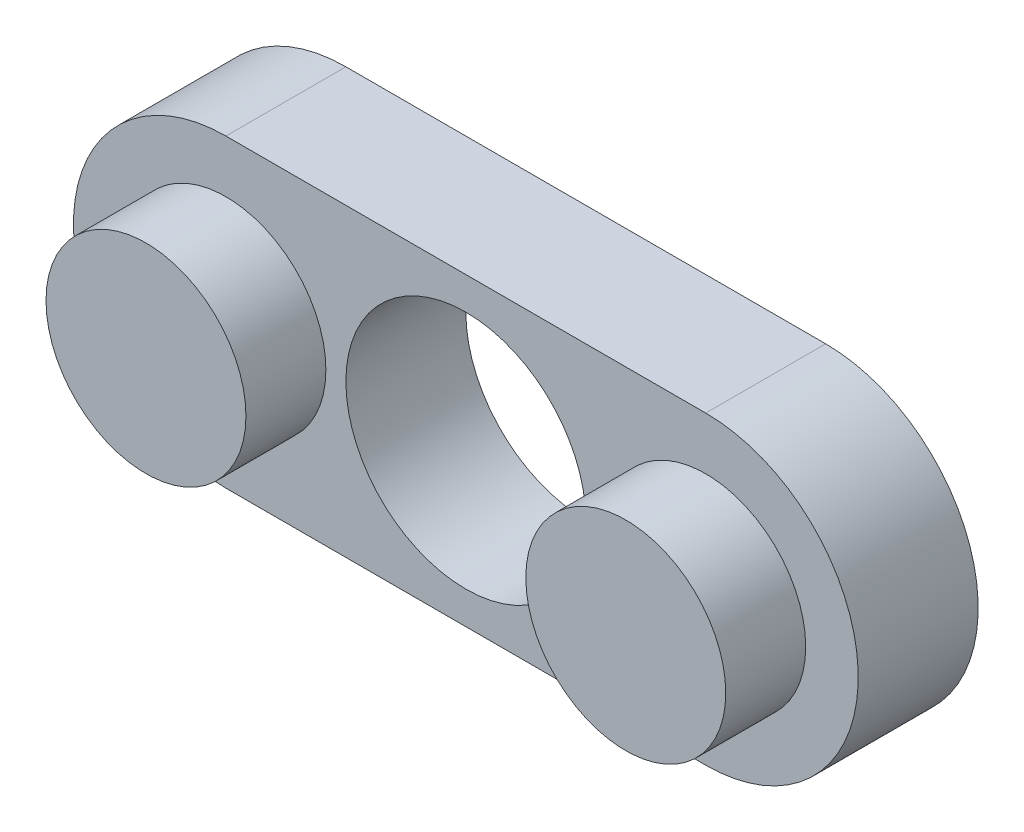
ISO-10303-21;
HEADER;
FILE_DESCRIPTION(('STEP AP214'),'2;1');
FILE_NAME('part.step','',(''),(''),'','','');
FILE_SCHEMA(('AUTOMOTIVE_DESIGN { 1 0 10303 214 1 1 1 1 }'));
ENDSEC;
DATA;
#1=APPLICATION_CONTEXT('core data for automotive mechanical design processes');
#2=APPLICATION_PROTOCOL_DEFINITION('international standard','automotive_design',2000,#1);
#3=PRODUCT_CONTEXT('',#1,'mechanical');
#4=PRODUCT('Part','Part','',(#3));
#5=PRODUCT_RELATED_PRODUCT_CATEGORY('part','',(#4));
#6=PRODUCT_DEFINITION_FORMATION('','',#4);
#7=PRODUCT_DEFINITION_CONTEXT('part definition',#1,'design');
#8=PRODUCT_DEFINITION('design','',#6,#7);
#9=PRODUCT_DEFINITION_SHAPE('','',#8);
#10=(LENGTH_UNIT() NAMED_UNIT(*) SI_UNIT(.MILLI.,.METRE.));
#11=(NAMED_UNIT(*) PLANE_ANGLE_UNIT() SI_UNIT($,.RADIAN.));
#12=(NAMED_UNIT(*) SI_UNIT($,.STERADIAN.) SOLID_ANGLE_UNIT());
#13=UNCERTAINTY_MEASURE_WITH_UNIT(LENGTH_MEASURE(1.E-05),#10,'distance_accuracy_value','');
#14=(GEOMETRIC_REPRESENTATION_CONTEXT(3) GLOBAL_UNCERTAINTY_ASSIGNED_CONTEXT((#13)) GLOBAL_UNIT_ASSIGNED_CONTEXT((#10,
#11,#12)) REPRESENTATION_CONTEXT('',''));
#15=CARTESIAN_POINT('',(0.,0.,0.));
#16=DIRECTION('',(0.,0.,1.));
#17=DIRECTION('',(1.,0.,0.));
#18=AXIS2_PLACEMENT_3D('',#15,#16,#17);
#19=CARTESIAN_POINT('',(12.,0.,-10.0710678118655));
#20=DIRECTION('',(0.,0.,1.));
#21=DIRECTION('',(1.,0.,0.));
#22=AXIS2_PLACEMENT_3D('',#19,#20,#21);
#23=CYLINDRICAL_SURFACE('',#22,2.5);
#24=CARTESIAN_POINT('',(12.,0.,-3.));
#25=DIRECTION('',(0.,0.,1.));
#26=DIRECTION('',(1.,0.,0.));
#27=AXIS2_PLACEMENT_3D('',#24,#25,#26);
#28=CIRCLE('',#27,2.5);
#29=CARTESIAN_POINT('',(14.5,0.,-3.));
#30=VERTEX_POINT('',#29);
#31=EDGE_CURVE('E11',#30,#30,#28,.F.);
#32=ORIENTED_EDGE('',*,*,#31,.F.);
#33=EDGE_LOOP('',(#32));
#34=FACE_BOUND('',#33,.T.);
#35=CARTESIAN_POINT('',(12.,0.,2.));
#36=DIRECTION('',(0.,0.,1.));
#37=DIRECTION('',(1.,0.,0.));
#38=AXIS2_PLACEMENT_3D('',#35,#36,#37);
#39=CIRCLE('',#38,2.5);
#40=CARTESIAN_POINT('',(14.5,0.,2.));
#41=VERTEX_POINT('',#40);
#42=EDGE_CURVE('E46',#41,#41,#39,.T.);
#43=ORIENTED_EDGE('',*,*,#42,.F.);
#44=EDGE_LOOP('',(#43));
#45=FACE_BOUND('',#44,.T.);
#46=ADVANCED_FACE('F40',(#34,#45),#23,.T.);
#47=CARTESIAN_POINT('',(0.,0.,-3.));
#48=DIRECTION('',(0.,0.,1.));
#49=DIRECTION('',(1.,0.,0.));
#50=AXIS2_PLACEMENT_3D('',#47,#48,#49);
#51=PLANE('',#50);
#52=ORIENTED_EDGE('',*,*,#31,.T.);
#53=EDGE_LOOP('',(#52));
#54=FACE_BOUND('',#53,.T.);
#55=ADVANCED_FACE('F55',(#54),#51,.F.);
#56=CARTESIAN_POINT('',(0.,0.,2.));
#57=DIRECTION('',(0.,0.,1.));
#58=DIRECTION('',(1.,0.,0.));
#59=AXIS2_PLACEMENT_3D('',#56,#57,#58);
#60=PLANE('',#59);
#61=ORIENTED_EDGE('',*,*,#42,.T.);
#62=EDGE_LOOP('',(#61));
#63=FACE_BOUND('',#62,.T.);
#64=ADVANCED_FACE('F52',(#63),#60,.T.);
#65=CLOSED_SHELL('',(#46,#55,#64));
#66=MANIFOLD_SOLID_BREP('B2',#65);
#67=CARTESIAN_POINT('',(0.,0.,-10.0710678118655));
#68=DIRECTION('',(0.,0.,1.));
#69=DIRECTION('',(1.,0.,0.));
#70=AXIS2_PLACEMENT_3D('',#67,#68,#69);
#71=CYLINDRICAL_SURFACE('',#70,2.5);
#72=CARTESIAN_POINT('',(0.,0.,-3.));
#73=DIRECTION('',(0.,0.,1.));
#74=DIRECTION('',(1.,0.,0.));
#75=AXIS2_PLACEMENT_3D('',#72,#73,#74);
#76=CIRCLE('',#75,2.5);
#77=CARTESIAN_POINT('',(2.5,0.,-3.));
#78=VERTEX_POINT('',#77);
#79=EDGE_CURVE('E39',#78,#78,#76,.F.);
#80=ORIENTED_EDGE('',*,*,#79,.F.);
#81=EDGE_LOOP('',(#80));
#82=FACE_BOUND('',#81,.T.);
#83=CARTESIAN_POINT('',(0.,0.,2.));
#84=DIRECTION('',(0.,0.,1.));
#85=DIRECTION('',(1.,0.,0.));
#86=AXIS2_PLACEMENT_3D('',#83,#84,#85);
#87=CIRCLE('',#86,2.5);
#88=CARTESIAN_POINT('',(2.5,0.,2.));
#89=VERTEX_POINT('',#88);
#90=EDGE_CURVE('E96',#89,#89,#87,.T.);
#91=ORIENTED_EDGE('',*,*,#90,.F.);
#92=EDGE_LOOP('',(#91));
#93=FACE_BOUND('',#92,.T.);
#94=ADVANCED_FACE('F90',(#82,#93),#71,.T.);
#95=CARTESIAN_POINT('',(0.,0.,-3.));
#96=DIRECTION('',(0.,0.,1.));
#97=DIRECTION('',(1.,0.,0.));
#98=AXIS2_PLACEMENT_3D('',#95,#96,#97);
#99=PLANE('',#98);
#100=ORIENTED_EDGE('',*,*,#79,.T.);
#101=EDGE_LOOP('',(#100));
#102=FACE_BOUND('',#101,.T.);
#103=ADVANCED_FACE('F105',(#102),#99,.F.);
#104=CARTESIAN_POINT('',(0.,0.,2.));
#105=DIRECTION('',(0.,0.,1.));
#106=DIRECTION('',(1.,0.,0.));
#107=AXIS2_PLACEMENT_3D('',#104,#105,#106);
#108=PLANE('',#107);
#109=ORIENTED_EDGE('',*,*,#90,.T.);
#110=EDGE_LOOP('',(#109));
#111=FACE_BOUND('',#110,.T.);
#112=ADVANCED_FACE('F102',(#111),#108,.T.);
#113=CLOSED_SHELL('',(#94,#103,#112));
#114=MANIFOLD_SOLID_BREP('B6',#113);
#115=CARTESIAN_POINT('',(0.,0.,-3.));
#116=DIRECTION('',(0.,0.,1.));
#117=DIRECTION('',(1.,0.,0.));
#118=AXIS2_PLACEMENT_3D('',#115,#116,#117);
#119=CYLINDRICAL_SURFACE('',#118,3.8135593220339);
#120=CARTESIAN_POINT('',(0.,0.,0.));
#121=DIRECTION('',(0.,0.,1.));
#122=DIRECTION('',(1.,0.,0.));
#123=AXIS2_PLACEMENT_3D('',#120,#121,#122);
#124=CIRCLE('',#123,3.8135593220339);
#125=CARTESIAN_POINT('',(0.,3.8135593220339,0.));
#126=VERTEX_POINT('',#125);
#127=CARTESIAN_POINT('',(0.,-3.8135593220339,0.));
#128=VERTEX_POINT('',#127);
#129=EDGE_CURVE('E198',#126,#128,#124,.T.);
#130=ORIENTED_EDGE('',*,*,#129,.F.);
#131=DIRECTION('',(0.,0.,1.));
#132=VECTOR('',#131,1.);
#133=CARTESIAN_POINT('',(0.,3.8135593220339,-3.));
#134=LINE('',#133,#132);
#135=CARTESIAN_POINT('',(0.,3.8135593220339,-3.));
#136=VERTEX_POINT('',#135);
#137=EDGE_CURVE('E88',#136,#126,#134,.T.);
#138=ORIENTED_EDGE('',*,*,#137,.F.);
#139=CARTESIAN_POINT('',(0.,0.,-3.));
#140=DIRECTION('',(0.,0.,1.));
#141=DIRECTION('',(1.,0.,0.));
#142=AXIS2_PLACEMENT_3D('',#139,#140,#141);
#143=CIRCLE('',#142,3.8135593220339);
#144=CARTESIAN_POINT('',(0.,-3.8135593220339,-3.));
#145=VERTEX_POINT('',#144);
#146=EDGE_CURVE('E191',#136,#145,#143,.T.);
#147=ORIENTED_EDGE('',*,*,#146,.T.);
#148=DIRECTION('',(0.,0.,1.));
#149=VECTOR('',#148,1.);
#150=CARTESIAN_POINT('',(0.,-3.8135593220339,-3.));
#151=LINE('',#150,#149);
#152=EDGE_CURVE('E174',#145,#128,#151,.T.);
#153=ORIENTED_EDGE('',*,*,#152,.T.);
#154=EDGE_LOOP('',(#130,#138,#147,#153));
#155=FACE_BOUND('',#154,.T.);
#156=ADVANCED_FACE('F131',(#155),#119,.T.);
#157=CARTESIAN_POINT('',(0.,3.8135593220339,-3.));
#158=DIRECTION('',(0.,1.,0.));
#159=DIRECTION('',(0.,0.,1.));
#160=AXIS2_PLACEMENT_3D('',#157,#158,#159);
#161=PLANE('',#160);
#162=DIRECTION('',(-1.,0.,0.));
#163=VECTOR('',#162,1.);
#164=CARTESIAN_POINT('',(0.,3.8135593220339,0.));
#165=LINE('',#164,#163);
#166=CARTESIAN_POINT('',(12.,3.8135593220339,0.));
#167=VERTEX_POINT('',#166);
#168=EDGE_CURVE('E193',#167,#126,#165,.T.);
#169=ORIENTED_EDGE('',*,*,#168,.F.);
#170=DIRECTION('',(0.,0.,1.));
#171=VECTOR('',#170,1.);
#172=CARTESIAN_POINT('',(12.,3.8135593220339,-3.));
#173=LINE('',#172,#171);
#174=CARTESIAN_POINT('',(12.,3.8135593220339,-3.));
#175=VERTEX_POINT('',#174);
#176=EDGE_CURVE('E140',#175,#167,#173,.T.);
#177=ORIENTED_EDGE('',*,*,#176,.F.);
#178=DIRECTION('',(-1.,0.,0.));
#179=VECTOR('',#178,1.);
#180=CARTESIAN_POINT('',(0.,3.8135593220339,-3.));
#181=LINE('',#180,#179);
#182=EDGE_CURVE('E188',#175,#136,#181,.T.);
#183=ORIENTED_EDGE('',*,*,#182,.T.);
#184=ORIENTED_EDGE('',*,*,#137,.T.);
#185=EDGE_LOOP('',(#169,#177,#183,#184));
#186=FACE_BOUND('',#185,.T.);
#187=ADVANCED_FACE('F209',(#186),#161,.T.);
#188=CARTESIAN_POINT('',(12.,0.,-3.));
#189=DIRECTION('',(0.,0.,1.));
#190=DIRECTION('',(1.,0.,0.));
#191=AXIS2_PLACEMENT_3D('',#188,#189,#190);
#192=CYLINDRICAL_SURFACE('',#191,3.8135593220339);
#193=CARTESIAN_POINT('',(12.,0.,0.));
#194=DIRECTION('',(0.,0.,1.));
#195=DIRECTION('',(1.,0.,0.));
#196=AXIS2_PLACEMENT_3D('',#193,#194,#195);
#197=CIRCLE('',#196,3.8135593220339);
#198=CARTESIAN_POINT('',(12.,-3.8135593220339,0.));
#199=VERTEX_POINT('',#198);
#200=EDGE_CURVE('E182',#199,#167,#197,.T.);
#201=ORIENTED_EDGE('',*,*,#200,.F.);
#202=DIRECTION('',(0.,0.,1.));
#203=VECTOR('',#202,1.);
#204=CARTESIAN_POINT('',(12.,-3.8135593220339,-3.));
#205=LINE('',#204,#203);
#206=CARTESIAN_POINT('',(12.,-3.8135593220339,-3.));
#207=VERTEX_POINT('',#206);
#208=EDGE_CURVE('E177',#207,#199,#205,.T.);
#209=ORIENTED_EDGE('',*,*,#208,.F.);
#210=CARTESIAN_POINT('',(12.,0.,-3.));
#211=DIRECTION('',(0.,0.,1.));
#212=DIRECTION('',(1.,0.,0.));
#213=AXIS2_PLACEMENT_3D('',#210,#211,#212);
#214=CIRCLE('',#213,3.8135593220339);
#215=EDGE_CURVE('E180',#207,#175,#214,.T.);
#216=ORIENTED_EDGE('',*,*,#215,.T.);
#217=ORIENTED_EDGE('',*,*,#176,.T.);
#218=EDGE_LOOP('',(#201,#209,#216,#217));
#219=FACE_BOUND('',#218,.T.);
#220=ADVANCED_FACE('F179',(#219),#192,.T.);
#221=CARTESIAN_POINT('',(0.,-3.8135593220339,-3.));
#222=DIRECTION('',(0.,-1.,0.));
#223=DIRECTION('',(0.,0.,-1.));
#224=AXIS2_PLACEMENT_3D('',#221,#222,#223);
#225=PLANE('',#224);
#226=DIRECTION('',(1.,0.,0.));
#227=VECTOR('',#226,1.);
#228=CARTESIAN_POINT('',(0.,-3.8135593220339,0.));
#229=LINE('',#228,#227);
#230=EDGE_CURVE('E201',#128,#199,#229,.T.);
#231=ORIENTED_EDGE('',*,*,#230,.F.);
#232=ORIENTED_EDGE('',*,*,#152,.F.);
#233=DIRECTION('',(1.,0.,0.));
#234=VECTOR('',#233,1.);
#235=CARTESIAN_POINT('',(0.,-3.8135593220339,-3.));
#236=LINE('',#235,#234);
#237=EDGE_CURVE('E187',#145,#207,#236,.T.);
#238=ORIENTED_EDGE('',*,*,#237,.T.);
#239=ORIENTED_EDGE('',*,*,#208,.T.);
#240=EDGE_LOOP('',(#231,#232,#238,#239));
#241=FACE_BOUND('',#240,.T.);
#242=ADVANCED_FACE('F190',(#241),#225,.T.);
#243=CARTESIAN_POINT('',(0.,0.,-3.));
#244=DIRECTION('',(0.,0.,1.));
#245=DIRECTION('',(1.,0.,0.));
#246=AXIS2_PLACEMENT_3D('',#243,#244,#245);
#247=PLANE('',#246);
#248=CARTESIAN_POINT('',(6.,0.,-3.));
#249=DIRECTION('',(0.,0.,-1.));
#250=DIRECTION('',(-1.,0.,0.));
#251=AXIS2_PLACEMENT_3D('',#248,#249,#250);
#252=CIRCLE('',#251,3.);
#253=CARTESIAN_POINT('',(3.,0.,-3.));
#254=VERTEX_POINT('',#253);
#255=EDGE_CURVE('E248',#254,#254,#252,.T.);
#256=ORIENTED_EDGE('',*,*,#255,.F.);
#257=EDGE_LOOP('',(#256));
#258=FACE_BOUND('',#257,.T.);
#259=CARTESIAN_POINT('',(12.,0.,-3.));
#260=DIRECTION('',(0.,0.,1.));
#261=DIRECTION('',(1.,0.,0.));
#262=AXIS2_PLACEMENT_3D('',#259,#260,#261);
#263=CIRCLE('',#262,2.5);
#264=CARTESIAN_POINT('',(14.5,0.,-3.));
#265=VERTEX_POINT('',#264);
#266=EDGE_CURVE('E252',#265,#265,#263,.T.);
#267=ORIENTED_EDGE('',*,*,#266,.T.);
#268=EDGE_LOOP('',(#267));
#269=FACE_BOUND('',#268,.T.);
#270=CARTESIAN_POINT('',(0.,0.,-3.));
#271=DIRECTION('',(0.,0.,1.));
#272=DIRECTION('',(1.,0.,0.));
#273=AXIS2_PLACEMENT_3D('',#270,#271,#272);
#274=CIRCLE('',#273,2.5);
#275=CARTESIAN_POINT('',(2.5,0.,-3.));
#276=VERTEX_POINT('',#275);
#277=EDGE_CURVE('E202',#276,#276,#274,.T.);
#278=ORIENTED_EDGE('',*,*,#277,.T.);
#279=EDGE_LOOP('',(#278));
#280=FACE_BOUND('',#279,.T.);
#281=ORIENTED_EDGE('',*,*,#146,.F.);
#282=ORIENTED_EDGE('',*,*,#182,.F.);
#283=ORIENTED_EDGE('',*,*,#215,.F.);
#284=ORIENTED_EDGE('',*,*,#237,.F.);
#285=EDGE_LOOP('',(#281,#282,#283,#284));
#286=FACE_BOUND('',#285,.T.);
#287=ADVANCED_FACE('F186',(#258,#269,#280,#286),#247,.F.);
#288=CARTESIAN_POINT('',(0.,0.,0.));
#289=DIRECTION('',(0.,0.,1.));
#290=DIRECTION('',(1.,0.,0.));
#291=AXIS2_PLACEMENT_3D('',#288,#289,#290);
#292=PLANE('',#291);
#293=CARTESIAN_POINT('',(6.,0.,0.));
#294=DIRECTION('',(0.,0.,1.));
#295=DIRECTION('',(1.,0.,0.));
#296=AXIS2_PLACEMENT_3D('',#293,#294,#295);
#297=CIRCLE('',#296,3.);
#298=CARTESIAN_POINT('',(9.,0.,0.));
#299=VERTEX_POINT('',#298);
#300=EDGE_CURVE('E134',#299,#299,#297,.T.);
#301=ORIENTED_EDGE('',*,*,#300,.F.);
#302=EDGE_LOOP('',(#301));
#303=FACE_BOUND('',#302,.T.);
#304=CARTESIAN_POINT('',(12.,0.,0.));
#305=DIRECTION('',(0.,0.,1.));
#306=DIRECTION('',(1.,0.,0.));
#307=AXIS2_PLACEMENT_3D('',#304,#305,#306);
#308=CIRCLE('',#307,2.5);
#309=CARTESIAN_POINT('',(14.5,0.,0.));
#310=VERTEX_POINT('',#309);
#311=EDGE_CURVE('E250',#310,#310,#308,.T.);
#312=ORIENTED_EDGE('',*,*,#311,.F.);
#313=EDGE_LOOP('',(#312));
#314=FACE_BOUND('',#313,.T.);
#315=CARTESIAN_POINT('',(0.,0.,0.));
#316=DIRECTION('',(0.,0.,1.));
#317=DIRECTION('',(1.,0.,0.));
#318=AXIS2_PLACEMENT_3D('',#315,#316,#317);
#319=CIRCLE('',#318,2.5);
#320=CARTESIAN_POINT('',(2.5,0.,0.));
#321=VERTEX_POINT('',#320);
#322=EDGE_CURVE('E255',#321,#321,#319,.T.);
#323=ORIENTED_EDGE('',*,*,#322,.F.);
#324=EDGE_LOOP('',(#323));
#325=FACE_BOUND('',#324,.T.);
#326=ORIENTED_EDGE('',*,*,#129,.T.);
#327=ORIENTED_EDGE('',*,*,#230,.T.);
#328=ORIENTED_EDGE('',*,*,#200,.T.);
#329=ORIENTED_EDGE('',*,*,#168,.T.);
#330=EDGE_LOOP('',(#326,#327,#328,#329));
#331=FACE_BOUND('',#330,.T.);
#332=ADVANCED_FACE('F208',(#303,#314,#325,#331),#292,.T.);
#333=CARTESIAN_POINT('',(0.,0.,-3.));
#334=DIRECTION('',(0.,0.,1.));
#335=DIRECTION('',(1.,0.,0.));
#336=AXIS2_PLACEMENT_3D('',#333,#334,#335);
#337=CYLINDRICAL_SURFACE('',#336,2.5);
#338=ORIENTED_EDGE('',*,*,#277,.F.);
#339=EDGE_LOOP('',(#338));
#340=FACE_BOUND('',#339,.T.);
#341=ORIENTED_EDGE('',*,*,#322,.T.);
#342=EDGE_LOOP('',(#341));
#343=FACE_BOUND('',#342,.T.);
#344=ADVANCED_FACE('F227',(#340,#343),#337,.F.);
#345=CARTESIAN_POINT('',(12.,0.,-3.));
#346=DIRECTION('',(0.,0.,1.));
#347=DIRECTION('',(1.,0.,0.));
#348=AXIS2_PLACEMENT_3D('',#345,#346,#347);
#349=CYLINDRICAL_SURFACE('',#348,2.5);
#350=ORIENTED_EDGE('',*,*,#266,.F.);
#351=EDGE_LOOP('',(#350));
#352=FACE_BOUND('',#351,.T.);
#353=ORIENTED_EDGE('',*,*,#311,.T.);
#354=EDGE_LOOP('',(#353));
#355=FACE_BOUND('',#354,.T.);
#356=ADVANCED_FACE('F234',(#352,#355),#349,.F.);
#357=CARTESIAN_POINT('',(6.,0.,2.));
#358=DIRECTION('',(0.,0.,-1.));
#359=DIRECTION('',(-1.,0.,0.));
#360=AXIS2_PLACEMENT_3D('',#357,#358,#359);
#361=CYLINDRICAL_SURFACE('',#360,3.);
#362=ORIENTED_EDGE('',*,*,#300,.T.);
#363=EDGE_LOOP('',(#362));
#364=FACE_BOUND('',#363,.T.);
#365=ORIENTED_EDGE('',*,*,#255,.T.);
#366=EDGE_LOOP('',(#365));
#367=FACE_BOUND('',#366,.T.);
#368=ADVANCED_FACE('F238',(#364,#367),#361,.F.);
#369=CLOSED_SHELL('',(#156,#187,#220,#242,#287,#332,#344,#356,#368));
#370=MANIFOLD_SOLID_BREP('B34',#369);
#371=ADVANCED_BREP_SHAPE_REPRESENTATION('',(#18,#66,#114,#370),#14);
#372=SHAPE_DEFINITION_REPRESENTATION(#9,#371);
ENDSEC;
END-ISO-10303-21;
